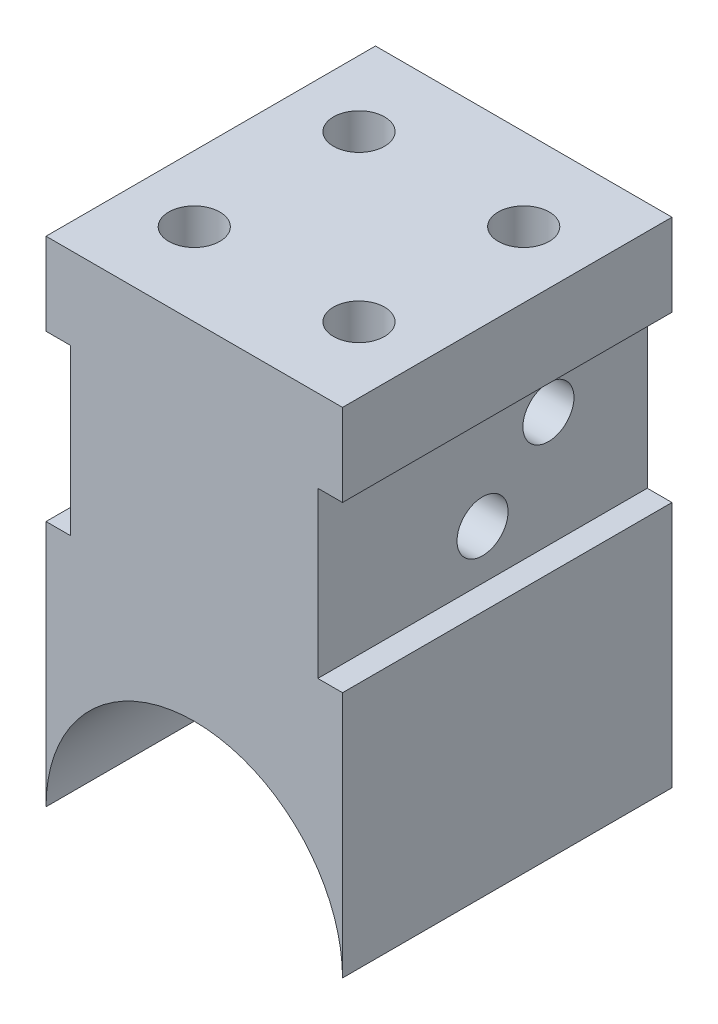
ISO-10303-21;
HEADER;
FILE_DESCRIPTION(('STEP AP214'),'2;1');
FILE_NAME('part.step','',(''),(''),'','','');
FILE_SCHEMA(('AUTOMOTIVE_DESIGN { 1 0 10303 214 1 1 1 1 }'));
ENDSEC;
DATA;
#1=APPLICATION_CONTEXT('core data for automotive mechanical design processes');
#2=APPLICATION_PROTOCOL_DEFINITION('international standard','automotive_design',2000,#1);
#3=PRODUCT_CONTEXT('',#1,'mechanical');
#4=PRODUCT('Part','Part','',(#3));
#5=PRODUCT_RELATED_PRODUCT_CATEGORY('part','',(#4));
#6=PRODUCT_DEFINITION_FORMATION('','',#4);
#7=PRODUCT_DEFINITION_CONTEXT('part definition',#1,'design');
#8=PRODUCT_DEFINITION('design','',#6,#7);
#9=PRODUCT_DEFINITION_SHAPE('','',#8);
#10=(LENGTH_UNIT() NAMED_UNIT(*) SI_UNIT(.MILLI.,.METRE.));
#11=(NAMED_UNIT(*) PLANE_ANGLE_UNIT() SI_UNIT($,.RADIAN.));
#12=(NAMED_UNIT(*) SI_UNIT($,.STERADIAN.) SOLID_ANGLE_UNIT());
#13=UNCERTAINTY_MEASURE_WITH_UNIT(LENGTH_MEASURE(1.E-05),#10,'distance_accuracy_value','');
#14=(GEOMETRIC_REPRESENTATION_CONTEXT(3) GLOBAL_UNCERTAINTY_ASSIGNED_CONTEXT((#13)) GLOBAL_UNIT_ASSIGNED_CONTEXT((#10,
#11,#12)) REPRESENTATION_CONTEXT('',''));
#15=CARTESIAN_POINT('',(0.,0.,0.));
#16=DIRECTION('',(0.,0.,1.));
#17=DIRECTION('',(1.,0.,0.));
#18=AXIS2_PLACEMENT_3D('',#15,#16,#17);
#19=CARTESIAN_POINT('',(9.,30.,20.));
#20=DIRECTION('',(-1.,0.,0.));
#21=DIRECTION('',(0.,0.,1.));
#22=AXIS2_PLACEMENT_3D('',#19,#20,#21);
#23=PLANE('',#22);
#24=DIRECTION('',(0.,0.,1.));
#25=VECTOR('',#24,1.);
#26=CARTESIAN_POINT('',(9.,15.,20.));
#27=LINE('',#26,#25);
#28=CARTESIAN_POINT('',(9.,15.,0.));
#29=VERTEX_POINT('',#28);
#30=CARTESIAN_POINT('',(9.,15.,20.));
#31=VERTEX_POINT('',#30);
#32=EDGE_CURVE('E149',#29,#31,#27,.T.);
#33=ORIENTED_EDGE('',*,*,#32,.T.);
#34=DIRECTION('',(0.,1.,0.));
#35=VECTOR('',#34,1.);
#36=CARTESIAN_POINT('',(9.,30.,20.));
#37=LINE('',#36,#35);
#38=CARTESIAN_POINT('',(9.,0.,20.));
#39=VERTEX_POINT('',#38);
#40=EDGE_CURVE('E203',#39,#31,#37,.T.);
#41=ORIENTED_EDGE('',*,*,#40,.F.);
#42=DIRECTION('',(0.,0.,-1.));
#43=VECTOR('',#42,1.);
#44=CARTESIAN_POINT('',(9.,0.,20.));
#45=LINE('',#44,#43);
#46=CARTESIAN_POINT('',(9.,0.,0.));
#47=VERTEX_POINT('',#46);
#48=EDGE_CURVE('E11',#39,#47,#45,.T.);
#49=ORIENTED_EDGE('',*,*,#48,.T.);
#50=DIRECTION('',(0.,1.,0.));
#51=VECTOR('',#50,1.);
#52=CARTESIAN_POINT('',(9.,30.,0.));
#53=LINE('',#52,#51);
#54=EDGE_CURVE('E219',#47,#29,#53,.T.);
#55=ORIENTED_EDGE('',*,*,#54,.T.);
#56=EDGE_LOOP('',(#33,#41,#49,#55));
#57=FACE_BOUND('',#56,.T.);
#58=ADVANCED_FACE('F39',(#57),#23,.F.);
#59=DIRECTION('',(0.,0.,-1.));
#60=VECTOR('',#59,1.);
#61=CARTESIAN_POINT('',(9.,25.,0.));
#62=LINE('',#61,#60);
#63=CARTESIAN_POINT('',(9.,25.,20.));
#64=VERTEX_POINT('',#63);
#65=CARTESIAN_POINT('',(9.,25.,0.));
#66=VERTEX_POINT('',#65);
#67=EDGE_CURVE('E266',#64,#66,#62,.T.);
#68=ORIENTED_EDGE('',*,*,#67,.T.);
#69=CARTESIAN_POINT('',(9.,30.,0.));
#70=VERTEX_POINT('',#69);
#71=EDGE_CURVE('E154',#66,#70,#53,.T.);
#72=ORIENTED_EDGE('',*,*,#71,.T.);
#73=DIRECTION('',(0.,0.,-1.));
#74=VECTOR('',#73,1.);
#75=CARTESIAN_POINT('',(9.,30.,20.));
#76=LINE('',#75,#74);
#77=CARTESIAN_POINT('',(9.,30.,20.));
#78=VERTEX_POINT('',#77);
#79=EDGE_CURVE('E48',#78,#70,#76,.T.);
#80=ORIENTED_EDGE('',*,*,#79,.F.);
#81=EDGE_CURVE('E201',#64,#78,#37,.T.);
#82=ORIENTED_EDGE('',*,*,#81,.F.);
#83=EDGE_LOOP('',(#68,#72,#80,#82));
#84=FACE_BOUND('',#83,.T.);
#85=ADVANCED_FACE('F338',(#84),#23,.F.);
#86=CARTESIAN_POINT('',(0.,0.,20.));
#87=DIRECTION('',(0.,0.,1.));
#88=DIRECTION('',(1.,0.,0.));
#89=AXIS2_PLACEMENT_3D('',#86,#87,#88);
#90=PLANE('',#89);
#91=ORIENTED_EDGE('',*,*,#40,.T.);
#92=DIRECTION('',(1.,0.,0.));
#93=VECTOR('',#92,1.);
#94=CARTESIAN_POINT('',(7.5,15.,20.));
#95=LINE('',#94,#93);
#96=CARTESIAN_POINT('',(7.5,15.,20.));
#97=VERTEX_POINT('',#96);
#98=EDGE_CURVE('E159',#97,#31,#95,.T.);
#99=ORIENTED_EDGE('',*,*,#98,.F.);
#100=DIRECTION('',(0.,1.,0.));
#101=VECTOR('',#100,1.);
#102=CARTESIAN_POINT('',(7.5,25.,20.));
#103=LINE('',#102,#101);
#104=CARTESIAN_POINT('',(7.5,25.,20.));
#105=VERTEX_POINT('',#104);
#106=EDGE_CURVE('E141',#97,#105,#103,.T.);
#107=ORIENTED_EDGE('',*,*,#106,.T.);
#108=DIRECTION('',(1.,0.,0.));
#109=VECTOR('',#108,1.);
#110=CARTESIAN_POINT('',(7.5,25.,20.));
#111=LINE('',#110,#109);
#112=EDGE_CURVE('E136',#105,#64,#111,.T.);
#113=ORIENTED_EDGE('',*,*,#112,.T.);
#114=ORIENTED_EDGE('',*,*,#81,.T.);
#115=DIRECTION('',(-1.,0.,0.));
#116=VECTOR('',#115,1.);
#117=CARTESIAN_POINT('',(-9.,30.,20.));
#118=LINE('',#117,#116);
#119=CARTESIAN_POINT('',(-9.,30.,20.));
#120=VERTEX_POINT('',#119);
#121=EDGE_CURVE('E207',#78,#120,#118,.T.);
#122=ORIENTED_EDGE('',*,*,#121,.T.);
#123=DIRECTION('',(0.,-1.,0.));
#124=VECTOR('',#123,1.);
#125=CARTESIAN_POINT('',(-9.,0.,20.));
#126=LINE('',#125,#124);
#127=CARTESIAN_POINT('',(-9.,25.,20.));
#128=VERTEX_POINT('',#127);
#129=EDGE_CURVE('E211',#120,#128,#126,.T.);
#130=ORIENTED_EDGE('',*,*,#129,.T.);
#131=DIRECTION('',(-1.,0.,0.));
#132=VECTOR('',#131,1.);
#133=CARTESIAN_POINT('',(-7.5,25.,20.));
#134=LINE('',#133,#132);
#135=CARTESIAN_POINT('',(-7.5,25.,20.));
#136=VERTEX_POINT('',#135);
#137=EDGE_CURVE('E188',#136,#128,#134,.T.);
#138=ORIENTED_EDGE('',*,*,#137,.F.);
#139=DIRECTION('',(0.,1.,0.));
#140=VECTOR('',#139,1.);
#141=CARTESIAN_POINT('',(-7.5,25.,20.));
#142=LINE('',#141,#140);
#143=CARTESIAN_POINT('',(-7.5,15.,20.));
#144=VERTEX_POINT('',#143);
#145=EDGE_CURVE('E172',#144,#136,#142,.T.);
#146=ORIENTED_EDGE('',*,*,#145,.F.);
#147=DIRECTION('',(-1.,0.,0.));
#148=VECTOR('',#147,1.);
#149=CARTESIAN_POINT('',(-7.5,15.,20.));
#150=LINE('',#149,#148);
#151=CARTESIAN_POINT('',(-9.,15.,20.));
#152=VERTEX_POINT('',#151);
#153=EDGE_CURVE('E191',#144,#152,#150,.T.);
#154=ORIENTED_EDGE('',*,*,#153,.T.);
#155=CARTESIAN_POINT('',(-9.,0.,20.));
#156=VERTEX_POINT('',#155);
#157=EDGE_CURVE('E210',#152,#156,#126,.T.);
#158=ORIENTED_EDGE('',*,*,#157,.T.);
#159=CARTESIAN_POINT('',(0.,0.,20.));
#160=DIRECTION('',(0.,0.,-1.));
#161=DIRECTION('',(1.,0.,0.));
#162=AXIS2_PLACEMENT_3D('',#159,#160,#161);
#163=CIRCLE('',#162,9.);
#164=EDGE_CURVE('E197',#156,#39,#163,.T.);
#165=ORIENTED_EDGE('',*,*,#164,.T.);
#166=EDGE_LOOP('',(#91,#99,#107,#113,#114,#122,#130,#138,#146,#154,#158,#165));
#167=FACE_BOUND('',#166,.T.);
#168=ADVANCED_FACE('F253',(#167),#90,.T.);
#169=CARTESIAN_POINT('',(0.,0.,0.));
#170=DIRECTION('',(0.,0.,1.));
#171=DIRECTION('',(1.,0.,0.));
#172=AXIS2_PLACEMENT_3D('',#169,#170,#171);
#173=PLANE('',#172);
#174=DIRECTION('',(1.,0.,0.));
#175=VECTOR('',#174,1.);
#176=CARTESIAN_POINT('',(7.5,15.,0.));
#177=LINE('',#176,#175);
#178=CARTESIAN_POINT('',(7.5,15.,0.));
#179=VERTEX_POINT('',#178);
#180=EDGE_CURVE('E55',#179,#29,#177,.T.);
#181=ORIENTED_EDGE('',*,*,#180,.T.);
#182=ORIENTED_EDGE('',*,*,#54,.F.);
#183=CARTESIAN_POINT('',(0.,0.,0.));
#184=DIRECTION('',(0.,0.,-1.));
#185=DIRECTION('',(1.,0.,0.));
#186=AXIS2_PLACEMENT_3D('',#183,#184,#185);
#187=CIRCLE('',#186,9.);
#188=CARTESIAN_POINT('',(-9.,0.,0.));
#189=VERTEX_POINT('',#188);
#190=EDGE_CURVE('E187',#189,#47,#187,.T.);
#191=ORIENTED_EDGE('',*,*,#190,.F.);
#192=DIRECTION('',(0.,-1.,0.));
#193=VECTOR('',#192,1.);
#194=CARTESIAN_POINT('',(-9.,0.,0.));
#195=LINE('',#194,#193);
#196=CARTESIAN_POINT('',(-9.,15.,0.));
#197=VERTEX_POINT('',#196);
#198=EDGE_CURVE('E226',#197,#189,#195,.T.);
#199=ORIENTED_EDGE('',*,*,#198,.F.);
#200=DIRECTION('',(-1.,0.,0.));
#201=VECTOR('',#200,1.);
#202=CARTESIAN_POINT('',(-7.5,15.,0.));
#203=LINE('',#202,#201);
#204=CARTESIAN_POINT('',(-7.5,15.,0.));
#205=VERTEX_POINT('',#204);
#206=EDGE_CURVE('E177',#205,#197,#203,.T.);
#207=ORIENTED_EDGE('',*,*,#206,.F.);
#208=DIRECTION('',(0.,-1.,0.));
#209=VECTOR('',#208,1.);
#210=CARTESIAN_POINT('',(-7.5,15.,0.));
#211=LINE('',#210,#209);
#212=CARTESIAN_POINT('',(-7.5,25.,0.));
#213=VERTEX_POINT('',#212);
#214=EDGE_CURVE('E164',#213,#205,#211,.T.);
#215=ORIENTED_EDGE('',*,*,#214,.F.);
#216=DIRECTION('',(-1.,0.,0.));
#217=VECTOR('',#216,1.);
#218=CARTESIAN_POINT('',(-7.5,25.,0.));
#219=LINE('',#218,#217);
#220=CARTESIAN_POINT('',(-9.,25.,0.));
#221=VERTEX_POINT('',#220);
#222=EDGE_CURVE('E183',#213,#221,#219,.T.);
#223=ORIENTED_EDGE('',*,*,#222,.T.);
#224=CARTESIAN_POINT('',(-9.,30.,0.));
#225=VERTEX_POINT('',#224);
#226=EDGE_CURVE('E202',#225,#221,#195,.T.);
#227=ORIENTED_EDGE('',*,*,#226,.F.);
#228=DIRECTION('',(-1.,0.,0.));
#229=VECTOR('',#228,1.);
#230=CARTESIAN_POINT('',(-9.,30.,0.));
#231=LINE('',#230,#229);
#232=EDGE_CURVE('E223',#70,#225,#231,.T.);
#233=ORIENTED_EDGE('',*,*,#232,.F.);
#234=ORIENTED_EDGE('',*,*,#71,.F.);
#235=DIRECTION('',(1.,0.,0.));
#236=VECTOR('',#235,1.);
#237=CARTESIAN_POINT('',(7.5,25.,0.));
#238=LINE('',#237,#236);
#239=CARTESIAN_POINT('',(7.5,25.,0.));
#240=VERTEX_POINT('',#239);
#241=EDGE_CURVE('E133',#240,#66,#238,.T.);
#242=ORIENTED_EDGE('',*,*,#241,.F.);
#243=DIRECTION('',(0.,-1.,0.));
#244=VECTOR('',#243,1.);
#245=CARTESIAN_POINT('',(7.5,15.,0.));
#246=LINE('',#245,#244);
#247=EDGE_CURVE('E142',#240,#179,#246,.T.);
#248=ORIENTED_EDGE('',*,*,#247,.T.);
#249=EDGE_LOOP('',(#181,#182,#191,#199,#207,#215,#223,#227,#233,#234,#242,#248));
#250=FACE_BOUND('',#249,.T.);
#251=ADVANCED_FACE('F152',(#250),#173,.F.);
#252=CARTESIAN_POINT('',(-9.,0.,20.));
#253=DIRECTION('',(1.,0.,0.));
#254=DIRECTION('',(0.,0.,-1.));
#255=AXIS2_PLACEMENT_3D('',#252,#253,#254);
#256=PLANE('',#255);
#257=ORIENTED_EDGE('',*,*,#226,.T.);
#258=DIRECTION('',(0.,0.,-1.));
#259=VECTOR('',#258,1.);
#260=CARTESIAN_POINT('',(-9.,25.,0.));
#261=LINE('',#260,#259);
#262=EDGE_CURVE('E168',#128,#221,#261,.T.);
#263=ORIENTED_EDGE('',*,*,#262,.F.);
#264=ORIENTED_EDGE('',*,*,#129,.F.);
#265=DIRECTION('',(0.,0.,-1.));
#266=VECTOR('',#265,1.);
#267=CARTESIAN_POINT('',(-9.,30.,20.));
#268=LINE('',#267,#266);
#269=EDGE_CURVE('E233',#120,#225,#268,.T.);
#270=ORIENTED_EDGE('',*,*,#269,.T.);
#271=EDGE_LOOP('',(#257,#263,#264,#270));
#272=FACE_BOUND('',#271,.T.);
#273=ADVANCED_FACE('F249',(#272),#256,.F.);
#274=CARTESIAN_POINT('',(0.,0.,20.));
#275=DIRECTION('',(0.,0.,-1.));
#276=DIRECTION('',(-1.,0.,0.));
#277=AXIS2_PLACEMENT_3D('',#274,#275,#276);
#278=CYLINDRICAL_SURFACE('',#277,9.);
#279=ORIENTED_EDGE('',*,*,#190,.T.);
#280=ORIENTED_EDGE('',*,*,#48,.F.);
#281=ORIENTED_EDGE('',*,*,#164,.F.);
#282=DIRECTION('',(0.,0.,-1.));
#283=VECTOR('',#282,1.);
#284=CARTESIAN_POINT('',(-9.,0.,20.));
#285=LINE('',#284,#283);
#286=EDGE_CURVE('E215',#156,#189,#285,.T.);
#287=ORIENTED_EDGE('',*,*,#286,.T.);
#288=EDGE_LOOP('',(#279,#280,#281,#287));
#289=FACE_BOUND('',#288,.T.);
#290=ADVANCED_FACE('F41',(#289),#278,.F.);
#291=CARTESIAN_POINT('',(-9.,30.,20.));
#292=DIRECTION('',(0.,-1.,0.));
#293=DIRECTION('',(0.,0.,-1.));
#294=AXIS2_PLACEMENT_3D('',#291,#292,#293);
#295=PLANE('',#294);
#296=CARTESIAN_POINT('',(-4.99999999999982,30.,15.0000000000001));
#297=DIRECTION('',(0.,1.,0.));
#298=DIRECTION('',(0.,0.,1.));
#299=AXIS2_PLACEMENT_3D('',#296,#297,#298);
#300=CIRCLE('',#299,1.55000000000013);
#301=CARTESIAN_POINT('',(-4.99999999999982,30.,16.5500000000002));
#302=VERTEX_POINT('',#301);
#303=EDGE_CURVE('E296',#302,#302,#300,.T.);
#304=ORIENTED_EDGE('',*,*,#303,.F.);
#305=EDGE_LOOP('',(#304));
#306=FACE_BOUND('',#305,.T.);
#307=CARTESIAN_POINT('',(5.0000000000001,30.,14.9999999999999));
#308=DIRECTION('',(0.,1.,0.));
#309=DIRECTION('',(0.,0.,1.));
#310=AXIS2_PLACEMENT_3D('',#307,#308,#309);
#311=CIRCLE('',#310,1.55);
#312=CARTESIAN_POINT('',(5.0000000000001,30.,16.5499999999999));
#313=VERTEX_POINT('',#312);
#314=EDGE_CURVE('E300',#313,#313,#311,.T.);
#315=ORIENTED_EDGE('',*,*,#314,.F.);
#316=EDGE_LOOP('',(#315));
#317=FACE_BOUND('',#316,.T.);
#318=CARTESIAN_POINT('',(4.99999999999983,30.,4.99999999999981));
#319=DIRECTION('',(0.,1.,0.));
#320=DIRECTION('',(0.,0.,1.));
#321=AXIS2_PLACEMENT_3D('',#318,#319,#320);
#322=CIRCLE('',#321,1.55000000000012);
#323=CARTESIAN_POINT('',(4.99999999999983,30.,6.54999999999993));
#324=VERTEX_POINT('',#323);
#325=EDGE_CURVE('E305',#324,#324,#322,.T.);
#326=ORIENTED_EDGE('',*,*,#325,.F.);
#327=EDGE_LOOP('',(#326));
#328=FACE_BOUND('',#327,.T.);
#329=CARTESIAN_POINT('',(-5.00000000000012,30.,5.0000000000001));
#330=DIRECTION('',(0.,1.,0.));
#331=DIRECTION('',(0.,0.,1.));
#332=AXIS2_PLACEMENT_3D('',#329,#330,#331);
#333=CIRCLE('',#332,1.55000000000015);
#334=CARTESIAN_POINT('',(-5.00000000000012,30.,6.55000000000025));
#335=VERTEX_POINT('',#334);
#336=EDGE_CURVE('E288',#335,#335,#333,.T.);
#337=ORIENTED_EDGE('',*,*,#336,.F.);
#338=EDGE_LOOP('',(#337));
#339=FACE_BOUND('',#338,.T.);
#340=ORIENTED_EDGE('',*,*,#232,.T.);
#341=ORIENTED_EDGE('',*,*,#269,.F.);
#342=ORIENTED_EDGE('',*,*,#121,.F.);
#343=ORIENTED_EDGE('',*,*,#79,.T.);
#344=EDGE_LOOP('',(#340,#341,#342,#343));
#345=FACE_BOUND('',#344,.T.);
#346=ADVANCED_FACE('F241',(#306,#317,#328,#339,#345),#295,.F.);
#347=ORIENTED_EDGE('',*,*,#157,.F.);
#348=DIRECTION('',(0.,0.,1.));
#349=VECTOR('',#348,1.);
#350=CARTESIAN_POINT('',(-9.,15.,20.));
#351=LINE('',#350,#349);
#352=EDGE_CURVE('E178',#197,#152,#351,.T.);
#353=ORIENTED_EDGE('',*,*,#352,.F.);
#354=ORIENTED_EDGE('',*,*,#198,.T.);
#355=ORIENTED_EDGE('',*,*,#286,.F.);
#356=EDGE_LOOP('',(#347,#353,#354,#355));
#357=FACE_BOUND('',#356,.T.);
#358=ADVANCED_FACE('F346',(#357),#256,.F.);
#359=CARTESIAN_POINT('',(-7.5,25.,0.));
#360=DIRECTION('',(0.,1.,0.));
#361=DIRECTION('',(0.,0.,1.));
#362=AXIS2_PLACEMENT_3D('',#359,#360,#361);
#363=PLANE('',#362);
#364=ORIENTED_EDGE('',*,*,#262,.T.);
#365=ORIENTED_EDGE('',*,*,#222,.F.);
#366=DIRECTION('',(0.,0.,-1.));
#367=VECTOR('',#366,1.);
#368=CARTESIAN_POINT('',(-7.5,25.,0.));
#369=LINE('',#368,#367);
#370=EDGE_CURVE('E63',#136,#213,#369,.T.);
#371=ORIENTED_EDGE('',*,*,#370,.F.);
#372=ORIENTED_EDGE('',*,*,#137,.T.);
#373=EDGE_LOOP('',(#364,#365,#371,#372));
#374=FACE_BOUND('',#373,.T.);
#375=ADVANCED_FACE('F350',(#374),#363,.F.);
#376=CARTESIAN_POINT('',(-7.5,15.,20.));
#377=DIRECTION('',(0.,-1.,0.));
#378=DIRECTION('',(0.,0.,-1.));
#379=AXIS2_PLACEMENT_3D('',#376,#377,#378);
#380=PLANE('',#379);
#381=ORIENTED_EDGE('',*,*,#352,.T.);
#382=ORIENTED_EDGE('',*,*,#153,.F.);
#383=DIRECTION('',(0.,0.,1.));
#384=VECTOR('',#383,1.);
#385=CARTESIAN_POINT('',(-7.5,15.,20.));
#386=LINE('',#385,#384);
#387=EDGE_CURVE('E167',#205,#144,#386,.T.);
#388=ORIENTED_EDGE('',*,*,#387,.F.);
#389=ORIENTED_EDGE('',*,*,#206,.T.);
#390=EDGE_LOOP('',(#381,#382,#388,#389));
#391=FACE_BOUND('',#390,.T.);
#392=ADVANCED_FACE('F356',(#391),#380,.F.);
#393=CARTESIAN_POINT('',(-7.5,0.,0.));
#394=DIRECTION('',(1.,0.,0.));
#395=DIRECTION('',(0.,0.,-1.));
#396=AXIS2_PLACEMENT_3D('',#393,#394,#395);
#397=PLANE('',#396);
#398=CARTESIAN_POINT('',(-7.5,22.,6.));
#399=DIRECTION('',(1.,0.,0.));
#400=DIRECTION('',(0.,0.,-1.));
#401=AXIS2_PLACEMENT_3D('',#398,#399,#400);
#402=CIRCLE('',#401,1.55);
#403=CARTESIAN_POINT('',(-7.5,22.,4.45));
#404=VERTEX_POINT('',#403);
#405=EDGE_CURVE('E268',#404,#404,#402,.F.);
#406=ORIENTED_EDGE('',*,*,#405,.F.);
#407=EDGE_LOOP('',(#406));
#408=FACE_BOUND('',#407,.T.);
#409=CARTESIAN_POINT('',(-7.5,18.,10.));
#410=DIRECTION('',(1.,0.,0.));
#411=DIRECTION('',(0.,0.,-1.));
#412=AXIS2_PLACEMENT_3D('',#409,#410,#411);
#413=CIRCLE('',#412,1.55);
#414=CARTESIAN_POINT('',(-7.5,18.,8.45));
#415=VERTEX_POINT('',#414);
#416=EDGE_CURVE('E272',#415,#415,#413,.F.);
#417=ORIENTED_EDGE('',*,*,#416,.F.);
#418=EDGE_LOOP('',(#417));
#419=FACE_BOUND('',#418,.T.);
#420=ORIENTED_EDGE('',*,*,#214,.T.);
#421=ORIENTED_EDGE('',*,*,#387,.T.);
#422=ORIENTED_EDGE('',*,*,#145,.T.);
#423=ORIENTED_EDGE('',*,*,#370,.T.);
#424=EDGE_LOOP('',(#420,#421,#422,#423));
#425=FACE_BOUND('',#424,.T.);
#426=ADVANCED_FACE('F359',(#408,#419,#425),#397,.F.);
#427=CARTESIAN_POINT('',(7.5,15.,20.));
#428=DIRECTION('',(0.,1.,0.));
#429=DIRECTION('',(0.,0.,1.));
#430=AXIS2_PLACEMENT_3D('',#427,#428,#429);
#431=PLANE('',#430);
#432=ORIENTED_EDGE('',*,*,#32,.F.);
#433=ORIENTED_EDGE('',*,*,#180,.F.);
#434=DIRECTION('',(0.,0.,1.));
#435=VECTOR('',#434,1.);
#436=CARTESIAN_POINT('',(7.5,15.,20.));
#437=LINE('',#436,#435);
#438=EDGE_CURVE('E146',#179,#97,#437,.T.);
#439=ORIENTED_EDGE('',*,*,#438,.T.);
#440=ORIENTED_EDGE('',*,*,#98,.T.);
#441=EDGE_LOOP('',(#432,#433,#439,#440));
#442=FACE_BOUND('',#441,.T.);
#443=ADVANCED_FACE('F366',(#442),#431,.T.);
#444=CARTESIAN_POINT('',(7.5,25.,0.));
#445=DIRECTION('',(0.,-1.,0.));
#446=DIRECTION('',(0.,0.,-1.));
#447=AXIS2_PLACEMENT_3D('',#444,#445,#446);
#448=PLANE('',#447);
#449=ORIENTED_EDGE('',*,*,#67,.F.);
#450=ORIENTED_EDGE('',*,*,#112,.F.);
#451=DIRECTION('',(0.,0.,-1.));
#452=VECTOR('',#451,1.);
#453=CARTESIAN_POINT('',(7.5,25.,0.));
#454=LINE('',#453,#452);
#455=EDGE_CURVE('E129',#105,#240,#454,.T.);
#456=ORIENTED_EDGE('',*,*,#455,.T.);
#457=ORIENTED_EDGE('',*,*,#241,.T.);
#458=EDGE_LOOP('',(#449,#450,#456,#457));
#459=FACE_BOUND('',#458,.T.);
#460=ADVANCED_FACE('F131',(#459),#448,.T.);
#461=CARTESIAN_POINT('',(7.5,0.,0.));
#462=DIRECTION('',(-1.,0.,0.));
#463=DIRECTION('',(0.,0.,-1.));
#464=AXIS2_PLACEMENT_3D('',#461,#462,#463);
#465=PLANE('',#464);
#466=CARTESIAN_POINT('',(7.5,22.,6.));
#467=DIRECTION('',(1.,0.,0.));
#468=DIRECTION('',(0.,0.,-1.));
#469=AXIS2_PLACEMENT_3D('',#466,#467,#468);
#470=CIRCLE('',#469,1.55);
#471=CARTESIAN_POINT('',(7.5,22.,4.45));
#472=VERTEX_POINT('',#471);
#473=EDGE_CURVE('E276',#472,#472,#470,.T.);
#474=ORIENTED_EDGE('',*,*,#473,.F.);
#475=EDGE_LOOP('',(#474));
#476=FACE_BOUND('',#475,.T.);
#477=CARTESIAN_POINT('',(7.5,18.,10.));
#478=DIRECTION('',(1.,0.,0.));
#479=DIRECTION('',(0.,0.,-1.));
#480=AXIS2_PLACEMENT_3D('',#477,#478,#479);
#481=CIRCLE('',#480,1.55);
#482=CARTESIAN_POINT('',(7.5,18.,8.45));
#483=VERTEX_POINT('',#482);
#484=EDGE_CURVE('E277',#483,#483,#481,.T.);
#485=ORIENTED_EDGE('',*,*,#484,.F.);
#486=EDGE_LOOP('',(#485));
#487=FACE_BOUND('',#486,.T.);
#488=ORIENTED_EDGE('',*,*,#247,.F.);
#489=ORIENTED_EDGE('',*,*,#455,.F.);
#490=ORIENTED_EDGE('',*,*,#106,.F.);
#491=ORIENTED_EDGE('',*,*,#438,.F.);
#492=EDGE_LOOP('',(#488,#489,#490,#491));
#493=FACE_BOUND('',#492,.T.);
#494=ADVANCED_FACE('F145',(#476,#487,#493),#465,.F.);
#495=CARTESIAN_POINT('',(-11.8840620433566,18.,10.));
#496=DIRECTION('',(1.,0.,0.));
#497=DIRECTION('',(0.,0.,-1.));
#498=AXIS2_PLACEMENT_3D('',#495,#496,#497);
#499=CYLINDRICAL_SURFACE('',#498,1.55);
#500=ORIENTED_EDGE('',*,*,#416,.T.);
#501=EDGE_LOOP('',(#500));
#502=FACE_BOUND('',#501,.T.);
#503=ORIENTED_EDGE('',*,*,#484,.T.);
#504=EDGE_LOOP('',(#503));
#505=FACE_BOUND('',#504,.T.);
#506=ADVANCED_FACE('F374',(#502,#505),#499,.F.);
#507=CARTESIAN_POINT('',(-11.8840620433566,22.,6.));
#508=DIRECTION('',(1.,0.,0.));
#509=DIRECTION('',(0.,0.,-1.));
#510=AXIS2_PLACEMENT_3D('',#507,#508,#509);
#511=CYLINDRICAL_SURFACE('',#510,1.55);
#512=ORIENTED_EDGE('',*,*,#405,.T.);
#513=EDGE_LOOP('',(#512));
#514=FACE_BOUND('',#513,.T.);
#515=ORIENTED_EDGE('',*,*,#473,.T.);
#516=EDGE_LOOP('',(#515));
#517=FACE_BOUND('',#516,.T.);
#518=ADVANCED_FACE('F378',(#514,#517),#511,.F.);
#519=CARTESIAN_POINT('',(-5.00000000000012,25.,5.0000000000001));
#520=DIRECTION('',(0.,1.,0.));
#521=DIRECTION('',(0.,0.,1.));
#522=AXIS2_PLACEMENT_3D('',#519,#520,#521);
#523=CYLINDRICAL_SURFACE('',#522,1.55000000000015);
#524=CARTESIAN_POINT('',(-5.00000000000012,25.,5.0000000000001));
#525=DIRECTION('',(0.,1.,0.));
#526=DIRECTION('',(0.,0.,1.));
#527=AXIS2_PLACEMENT_3D('',#524,#525,#526);
#528=CIRCLE('',#527,1.55000000000015);
#529=CARTESIAN_POINT('',(-5.00000000000012,25.,6.55000000000025));
#530=VERTEX_POINT('',#529);
#531=EDGE_CURVE('E281',#530,#530,#528,.T.);
#532=ORIENTED_EDGE('',*,*,#531,.F.);
#533=EDGE_LOOP('',(#532));
#534=FACE_BOUND('',#533,.T.);
#535=ORIENTED_EDGE('',*,*,#336,.T.);
#536=EDGE_LOOP('',(#535));
#537=FACE_BOUND('',#536,.T.);
#538=ADVANCED_FACE('F382',(#534,#537),#523,.F.);
#539=CARTESIAN_POINT('',(-5.00000000000012,25.,5.0000000000001));
#540=DIRECTION('',(0.,1.,0.));
#541=DIRECTION('',(0.,0.,1.));
#542=AXIS2_PLACEMENT_3D('',#539,#540,#541);
#543=PLANE('',#542);
#544=ORIENTED_EDGE('',*,*,#531,.T.);
#545=EDGE_LOOP('',(#544));
#546=FACE_BOUND('',#545,.T.);
#547=ADVANCED_FACE('F385',(#546),#543,.T.);
#548=CARTESIAN_POINT('',(4.99999999999983,25.,4.99999999999981));
#549=DIRECTION('',(0.,1.,0.));
#550=DIRECTION('',(0.,0.,1.));
#551=AXIS2_PLACEMENT_3D('',#548,#549,#550);
#552=CYLINDRICAL_SURFACE('',#551,1.55000000000012);
#553=CARTESIAN_POINT('',(4.99999999999983,25.,4.99999999999981));
#554=DIRECTION('',(0.,1.,0.));
#555=DIRECTION('',(0.,0.,1.));
#556=AXIS2_PLACEMENT_3D('',#553,#554,#555);
#557=CIRCLE('',#556,1.55000000000012);
#558=CARTESIAN_POINT('',(4.99999999999983,25.,6.54999999999993));
#559=VERTEX_POINT('',#558);
#560=EDGE_CURVE('E292',#559,#559,#557,.T.);
#561=ORIENTED_EDGE('',*,*,#560,.F.);
#562=EDGE_LOOP('',(#561));
#563=FACE_BOUND('',#562,.T.);
#564=ORIENTED_EDGE('',*,*,#325,.T.);
#565=EDGE_LOOP('',(#564));
#566=FACE_BOUND('',#565,.T.);
#567=ADVANCED_FACE('F388',(#563,#566),#552,.F.);
#568=CARTESIAN_POINT('',(4.99999999999983,25.,4.99999999999981));
#569=DIRECTION('',(0.,1.,0.));
#570=DIRECTION('',(0.,0.,1.));
#571=AXIS2_PLACEMENT_3D('',#568,#569,#570);
#572=PLANE('',#571);
#573=ORIENTED_EDGE('',*,*,#560,.T.);
#574=EDGE_LOOP('',(#573));
#575=FACE_BOUND('',#574,.T.);
#576=ADVANCED_FACE('F333',(#575),#572,.T.);
#577=CARTESIAN_POINT('',(5.0000000000001,25.,14.9999999999999));
#578=DIRECTION('',(0.,1.,0.));
#579=DIRECTION('',(0.,0.,1.));
#580=AXIS2_PLACEMENT_3D('',#577,#578,#579);
#581=CYLINDRICAL_SURFACE('',#580,1.55);
#582=ORIENTED_EDGE('',*,*,#314,.T.);
#583=EDGE_LOOP('',(#582));
#584=FACE_BOUND('',#583,.T.);
#585=CARTESIAN_POINT('',(5.0000000000001,20.,14.9999999999999));
#586=DIRECTION('',(0.,1.,0.));
#587=DIRECTION('',(0.,0.,1.));
#588=AXIS2_PLACEMENT_3D('',#585,#586,#587);
#589=CIRCLE('',#588,1.55);
#590=CARTESIAN_POINT('',(5.0000000000001,20.,16.5499999999999));
#591=VERTEX_POINT('',#590);
#592=EDGE_CURVE('E312',#591,#591,#589,.T.);
#593=ORIENTED_EDGE('',*,*,#592,.F.);
#594=EDGE_LOOP('',(#593));
#595=FACE_BOUND('',#594,.T.);
#596=ADVANCED_FACE('F324',(#584,#595),#581,.F.);
#597=CARTESIAN_POINT('',(-4.99999999999982,25.,15.0000000000001));
#598=DIRECTION('',(0.,1.,0.));
#599=DIRECTION('',(0.,0.,1.));
#600=AXIS2_PLACEMENT_3D('',#597,#598,#599);
#601=CYLINDRICAL_SURFACE('',#600,1.55000000000013);
#602=ORIENTED_EDGE('',*,*,#303,.T.);
#603=EDGE_LOOP('',(#602));
#604=FACE_BOUND('',#603,.T.);
#605=CARTESIAN_POINT('',(-4.99999999999982,20.,15.0000000000001));
#606=DIRECTION('',(0.,1.,0.));
#607=DIRECTION('',(0.,0.,1.));
#608=AXIS2_PLACEMENT_3D('',#605,#606,#607);
#609=CIRCLE('',#608,1.55000000000013);
#610=CARTESIAN_POINT('',(-4.99999999999982,20.,16.5500000000002));
#611=VERTEX_POINT('',#610);
#612=EDGE_CURVE('E301',#611,#611,#609,.T.);
#613=ORIENTED_EDGE('',*,*,#612,.F.);
#614=EDGE_LOOP('',(#613));
#615=FACE_BOUND('',#614,.T.);
#616=ADVANCED_FACE('F322',(#604,#615),#601,.F.);
#617=CARTESIAN_POINT('',(-4.99999999999982,20.,15.0000000000001));
#618=DIRECTION('',(0.,1.,0.));
#619=DIRECTION('',(0.,0.,1.));
#620=AXIS2_PLACEMENT_3D('',#617,#618,#619);
#621=PLANE('',#620);
#622=ORIENTED_EDGE('',*,*,#612,.T.);
#623=EDGE_LOOP('',(#622));
#624=FACE_BOUND('',#623,.T.);
#625=ADVANCED_FACE('F320',(#624),#621,.T.);
#626=CARTESIAN_POINT('',(5.0000000000001,20.,14.9999999999999));
#627=DIRECTION('',(0.,1.,0.));
#628=DIRECTION('',(0.,0.,1.));
#629=AXIS2_PLACEMENT_3D('',#626,#627,#628);
#630=PLANE('',#629);
#631=ORIENTED_EDGE('',*,*,#592,.T.);
#632=EDGE_LOOP('',(#631));
#633=FACE_BOUND('',#632,.T.);
#634=ADVANCED_FACE('F331',(#633),#630,.T.);
#635=CLOSED_SHELL('',(#58,#85,#168,#251,#273,#290,#346,#358,#375,#392,#426,#443,#460,#494,#506,
#518,#538,#547,#567,#576,#596,#616,#625,#634));
#636=MANIFOLD_SOLID_BREP('B2',#635);
#637=ADVANCED_BREP_SHAPE_REPRESENTATION('',(#18,#636),#14);
#638=SHAPE_DEFINITION_REPRESENTATION(#9,#637);
ENDSEC;
END-ISO-10303-21;
